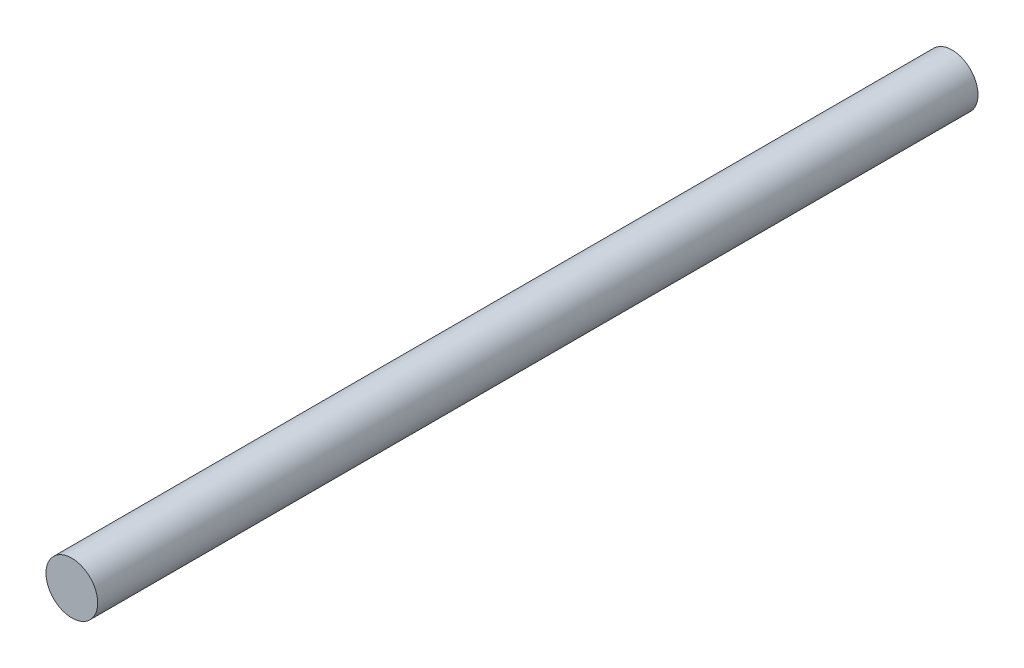
ISO-10303-21;
HEADER;
FILE_DESCRIPTION(('STEP AP214'),'2;1');
FILE_NAME('part.step','',(''),(''),'','','');
FILE_SCHEMA(('AUTOMOTIVE_DESIGN { 1 0 10303 214 1 1 1 1 }'));
ENDSEC;
DATA;
#1=APPLICATION_CONTEXT('core data for automotive mechanical design processes');
#2=APPLICATION_PROTOCOL_DEFINITION('international standard','automotive_design',2000,#1);
#3=PRODUCT_CONTEXT('',#1,'mechanical');
#4=PRODUCT('Part','Part','',(#3));
#5=PRODUCT_RELATED_PRODUCT_CATEGORY('part','',(#4));
#6=PRODUCT_DEFINITION_FORMATION('','',#4);
#7=PRODUCT_DEFINITION_CONTEXT('part definition',#1,'design');
#8=PRODUCT_DEFINITION('design','',#6,#7);
#9=PRODUCT_DEFINITION_SHAPE('','',#8);
#10=(LENGTH_UNIT() NAMED_UNIT(*) SI_UNIT(.MILLI.,.METRE.));
#11=(NAMED_UNIT(*) PLANE_ANGLE_UNIT() SI_UNIT($,.RADIAN.));
#12=(NAMED_UNIT(*) SI_UNIT($,.STERADIAN.) SOLID_ANGLE_UNIT());
#13=UNCERTAINTY_MEASURE_WITH_UNIT(LENGTH_MEASURE(1.E-05),#10,'distance_accuracy_value','');
#14=(GEOMETRIC_REPRESENTATION_CONTEXT(3) GLOBAL_UNCERTAINTY_ASSIGNED_CONTEXT((#13)) GLOBAL_UNIT_ASSIGNED_CONTEXT((#10,
#11,#12)) REPRESENTATION_CONTEXT('',''));
#15=CARTESIAN_POINT('',(0.,0.,0.));
#16=DIRECTION('',(0.,0.,1.));
#17=DIRECTION('',(1.,0.,0.));
#18=AXIS2_PLACEMENT_3D('',#15,#16,#17);
#19=CARTESIAN_POINT('',(0.,0.,68.));
#20=DIRECTION('',(0.,0.,-1.));
#21=DIRECTION('',(-1.,0.,0.));
#22=AXIS2_PLACEMENT_3D('',#19,#20,#21);
#23=CYLINDRICAL_SURFACE('',#22,2.);
#24=CARTESIAN_POINT('',(0.,0.,68.));
#25=DIRECTION('',(0.,0.,1.));
#26=DIRECTION('',(1.,0.,0.));
#27=AXIS2_PLACEMENT_3D('',#24,#25,#26);
#28=CIRCLE('',#27,2.);
#29=CARTESIAN_POINT('',(2.,0.,68.));
#30=VERTEX_POINT('',#29);
#31=EDGE_CURVE('E10',#30,#30,#28,.T.);
#32=ORIENTED_EDGE('',*,*,#31,.F.);
#33=EDGE_LOOP('',(#32));
#34=FACE_BOUND('',#33,.T.);
#35=CARTESIAN_POINT('',(0.,0.,0.));
#36=DIRECTION('',(0.,0.,1.));
#37=DIRECTION('',(1.,0.,0.));
#38=AXIS2_PLACEMENT_3D('',#35,#36,#37);
#39=CIRCLE('',#38,2.);
#40=CARTESIAN_POINT('',(2.,0.,0.));
#41=VERTEX_POINT('',#40);
#42=EDGE_CURVE('E44',#41,#41,#39,.T.);
#43=ORIENTED_EDGE('',*,*,#42,.T.);
#44=EDGE_LOOP('',(#43));
#45=FACE_BOUND('',#44,.T.);
#46=ADVANCED_FACE('F41',(#34,#45),#23,.T.);
#47=CARTESIAN_POINT('',(0.,0.,68.));
#48=DIRECTION('',(0.,0.,1.));
#49=DIRECTION('',(1.,0.,0.));
#50=AXIS2_PLACEMENT_3D('',#47,#48,#49);
#51=PLANE('',#50);
#52=ORIENTED_EDGE('',*,*,#31,.T.);
#53=EDGE_LOOP('',(#52));
#54=FACE_BOUND('',#53,.T.);
#55=ADVANCED_FACE('F58',(#54),#51,.T.);
#56=CARTESIAN_POINT('',(0.,0.,0.));
#57=DIRECTION('',(0.,0.,1.));
#58=DIRECTION('',(1.,0.,0.));
#59=AXIS2_PLACEMENT_3D('',#56,#57,#58);
#60=PLANE('',#59);
#61=ORIENTED_EDGE('',*,*,#42,.F.);
#62=EDGE_LOOP('',(#61));
#63=FACE_BOUND('',#62,.T.);
#64=ADVANCED_FACE('F56',(#63),#60,.F.);
#65=CLOSED_SHELL('',(#46,#55,#64));
#66=MANIFOLD_SOLID_BREP('B2',#65);
#67=ADVANCED_BREP_SHAPE_REPRESENTATION('',(#18,#66),#14);
#68=SHAPE_DEFINITION_REPRESENTATION(#9,#67);
ENDSEC;
END-ISO-10303-21;
